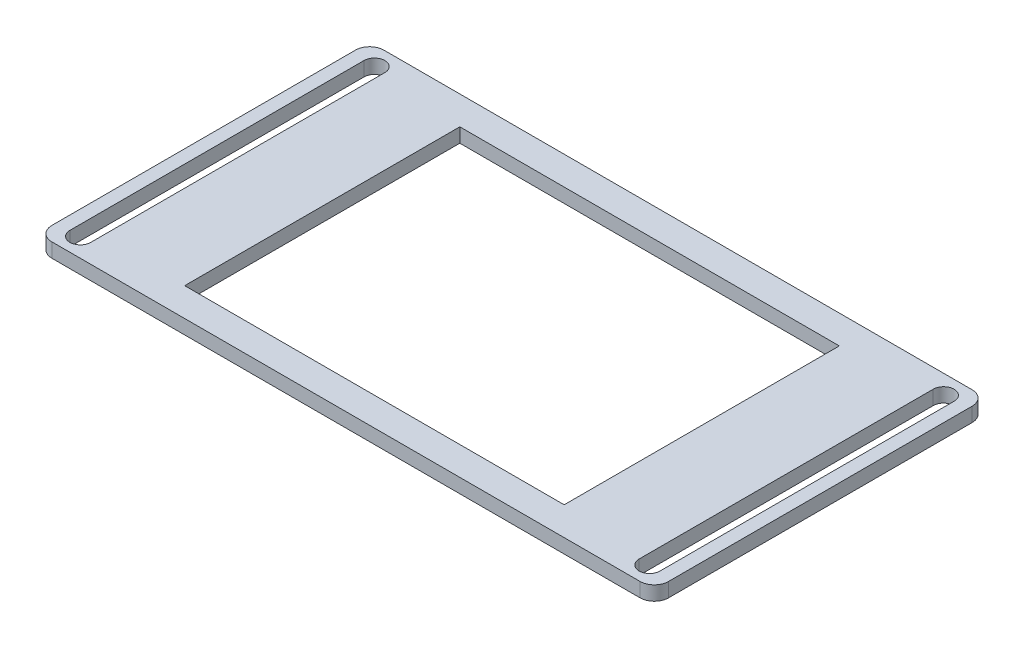
ISO-10303-21;
HEADER;
FILE_DESCRIPTION(('STEP AP214'),'2;1');
FILE_NAME('part.step','',(''),(''),'','','');
FILE_SCHEMA(('AUTOMOTIVE_DESIGN { 1 0 10303 214 1 1 1 1 }'));
ENDSEC;
DATA;
#1=APPLICATION_CONTEXT('core data for automotive mechanical design processes');
#2=APPLICATION_PROTOCOL_DEFINITION('international standard','automotive_design',2000,#1);
#3=PRODUCT_CONTEXT('',#1,'mechanical');
#4=PRODUCT('Part','Part','',(#3));
#5=PRODUCT_RELATED_PRODUCT_CATEGORY('part','',(#4));
#6=PRODUCT_DEFINITION_FORMATION('','',#4);
#7=PRODUCT_DEFINITION_CONTEXT('part definition',#1,'design');
#8=PRODUCT_DEFINITION('design','',#6,#7);
#9=PRODUCT_DEFINITION_SHAPE('','',#8);
#10=(LENGTH_UNIT() NAMED_UNIT(*) SI_UNIT(.MILLI.,.METRE.));
#11=(NAMED_UNIT(*) PLANE_ANGLE_UNIT() SI_UNIT($,.RADIAN.));
#12=(NAMED_UNIT(*) SI_UNIT($,.STERADIAN.) SOLID_ANGLE_UNIT());
#13=UNCERTAINTY_MEASURE_WITH_UNIT(LENGTH_MEASURE(1.E-05),#10,'distance_accuracy_value','');
#14=(GEOMETRIC_REPRESENTATION_CONTEXT(3) GLOBAL_UNCERTAINTY_ASSIGNED_CONTEXT((#13)) GLOBAL_UNIT_ASSIGNED_CONTEXT((#10,
#11,#12)) REPRESENTATION_CONTEXT('',''));
#15=CARTESIAN_POINT('',(0.,0.,0.));
#16=DIRECTION('',(0.,0.,1.));
#17=DIRECTION('',(1.,0.,0.));
#18=AXIS2_PLACEMENT_3D('',#15,#16,#17);
#19=CARTESIAN_POINT('',(0.,1.5,0.));
#20=DIRECTION('',(0.,-1.,0.));
#21=DIRECTION('',(0.,0.,-1.));
#22=AXIS2_PLACEMENT_3D('',#19,#20,#21);
#23=PLANE('',#22);
#24=DIRECTION('',(0.,0.,-1.));
#25=VECTOR('',#24,1.);
#26=CARTESIAN_POINT('',(31.1,1.5,15.5));
#27=LINE('',#26,#25);
#28=CARTESIAN_POINT('',(31.1,1.5,15.5));
#29=VERTEX_POINT('',#28);
#30=CARTESIAN_POINT('',(31.1,1.5,-15.5));
#31=VERTEX_POINT('',#30);
#32=EDGE_CURVE('E205',#29,#31,#27,.T.);
#33=ORIENTED_EDGE('',*,*,#32,.F.);
#34=CARTESIAN_POINT('',(30.,1.5,15.5));
#35=DIRECTION('',(0.,1.,0.));
#36=DIRECTION('',(0.,0.,-1.));
#37=AXIS2_PLACEMENT_3D('',#34,#35,#36);
#38=CIRCLE('',#37,1.10000000000001);
#39=CARTESIAN_POINT('',(28.9,1.5,15.5));
#40=VERTEX_POINT('',#39);
#41=EDGE_CURVE('E178',#40,#29,#38,.T.);
#42=ORIENTED_EDGE('',*,*,#41,.F.);
#43=DIRECTION('',(0.,0.,1.));
#44=VECTOR('',#43,1.);
#45=CARTESIAN_POINT('',(28.9,1.5,15.5));
#46=LINE('',#45,#44);
#47=CARTESIAN_POINT('',(28.9,1.5,-15.5));
#48=VERTEX_POINT('',#47);
#49=EDGE_CURVE('E196',#48,#40,#46,.T.);
#50=ORIENTED_EDGE('',*,*,#49,.F.);
#51=CARTESIAN_POINT('',(30.,1.5,-15.5));
#52=DIRECTION('',(0.,1.,0.));
#53=DIRECTION('',(0.,0.,-1.));
#54=AXIS2_PLACEMENT_3D('',#51,#52,#53);
#55=CIRCLE('',#54,1.10000000000001);
#56=EDGE_CURVE('E199',#31,#48,#55,.T.);
#57=ORIENTED_EDGE('',*,*,#56,.F.);
#58=EDGE_LOOP('',(#33,#42,#50,#57));
#59=FACE_BOUND('',#58,.T.);
#60=DIRECTION('',(0.,0.,-1.));
#61=VECTOR('',#60,1.);
#62=CARTESIAN_POINT('',(-28.9,1.5,15.5));
#63=LINE('',#62,#61);
#64=CARTESIAN_POINT('',(-28.9,1.5,15.5));
#65=VERTEX_POINT('',#64);
#66=CARTESIAN_POINT('',(-28.9,1.5,-15.5));
#67=VERTEX_POINT('',#66);
#68=EDGE_CURVE('E230',#65,#67,#63,.T.);
#69=ORIENTED_EDGE('',*,*,#68,.F.);
#70=CARTESIAN_POINT('',(-30.,1.5,15.5));
#71=DIRECTION('',(0.,1.,0.));
#72=DIRECTION('',(0.,0.,1.));
#73=AXIS2_PLACEMENT_3D('',#70,#71,#72);
#74=CIRCLE('',#73,1.10000000000001);
#75=CARTESIAN_POINT('',(-31.1,1.5,15.5));
#76=VERTEX_POINT('',#75);
#77=EDGE_CURVE('E211',#76,#65,#74,.T.);
#78=ORIENTED_EDGE('',*,*,#77,.F.);
#79=DIRECTION('',(0.,0.,1.));
#80=VECTOR('',#79,1.);
#81=CARTESIAN_POINT('',(-31.1,1.5,15.5));
#82=LINE('',#81,#80);
#83=CARTESIAN_POINT('',(-31.1,1.5,-15.5));
#84=VERTEX_POINT('',#83);
#85=EDGE_CURVE('E219',#84,#76,#82,.T.);
#86=ORIENTED_EDGE('',*,*,#85,.F.);
#87=CARTESIAN_POINT('',(-30.,1.5,-15.5));
#88=DIRECTION('',(0.,1.,0.));
#89=DIRECTION('',(0.,0.,1.));
#90=AXIS2_PLACEMENT_3D('',#87,#88,#89);
#91=CIRCLE('',#90,1.10000000000001);
#92=EDGE_CURVE('E233',#67,#84,#91,.T.);
#93=ORIENTED_EDGE('',*,*,#92,.F.);
#94=EDGE_LOOP('',(#69,#78,#86,#93));
#95=FACE_BOUND('',#94,.T.);
#96=DIRECTION('',(1.,0.,0.));
#97=VECTOR('',#96,1.);
#98=CARTESIAN_POINT('',(-32.5,1.5,17.5));
#99=LINE('',#98,#97);
#100=CARTESIAN_POINT('',(-31.,1.5,17.5));
#101=VERTEX_POINT('',#100);
#102=CARTESIAN_POINT('',(31.,1.5,17.5));
#103=VERTEX_POINT('',#102);
#104=EDGE_CURVE('E286',#101,#103,#99,.T.);
#105=ORIENTED_EDGE('',*,*,#104,.T.);
#106=CARTESIAN_POINT('',(31.,1.5,16.));
#107=DIRECTION('',(0.,-1.,0.));
#108=DIRECTION('',(0.,0.,-1.));
#109=AXIS2_PLACEMENT_3D('',#106,#107,#108);
#110=CIRCLE('',#109,1.5);
#111=CARTESIAN_POINT('',(32.5,1.5,16.));
#112=VERTEX_POINT('',#111);
#113=EDGE_CURVE('E321',#103,#112,#110,.F.);
#114=ORIENTED_EDGE('',*,*,#113,.T.);
#115=DIRECTION('',(0.,0.,-1.));
#116=VECTOR('',#115,1.);
#117=CARTESIAN_POINT('',(32.5,1.5,17.5));
#118=LINE('',#117,#116);
#119=CARTESIAN_POINT('',(32.5,1.5,-16.));
#120=VERTEX_POINT('',#119);
#121=EDGE_CURVE('E278',#112,#120,#118,.T.);
#122=ORIENTED_EDGE('',*,*,#121,.T.);
#123=CARTESIAN_POINT('',(31.,1.5,-16.));
#124=DIRECTION('',(0.,-1.,0.));
#125=DIRECTION('',(0.,0.,-1.));
#126=AXIS2_PLACEMENT_3D('',#123,#124,#125);
#127=CIRCLE('',#126,1.5);
#128=CARTESIAN_POINT('',(31.,1.5,-17.5));
#129=VERTEX_POINT('',#128);
#130=EDGE_CURVE('E317',#120,#129,#127,.F.);
#131=ORIENTED_EDGE('',*,*,#130,.T.);
#132=DIRECTION('',(-1.,0.,0.));
#133=VECTOR('',#132,1.);
#134=CARTESIAN_POINT('',(-32.5,1.5,-17.5));
#135=LINE('',#134,#133);
#136=CARTESIAN_POINT('',(-31.,1.5,-17.5));
#137=VERTEX_POINT('',#136);
#138=EDGE_CURVE('E281',#129,#137,#135,.T.);
#139=ORIENTED_EDGE('',*,*,#138,.T.);
#140=CARTESIAN_POINT('',(-31.,1.5,-16.));
#141=DIRECTION('',(0.,-1.,0.));
#142=DIRECTION('',(0.,0.,-1.));
#143=AXIS2_PLACEMENT_3D('',#140,#141,#142);
#144=CIRCLE('',#143,1.5);
#145=CARTESIAN_POINT('',(-32.5,1.5,-16.));
#146=VERTEX_POINT('',#145);
#147=EDGE_CURVE('E54',#137,#146,#144,.F.);
#148=ORIENTED_EDGE('',*,*,#147,.T.);
#149=DIRECTION('',(0.,0.,1.));
#150=VECTOR('',#149,1.);
#151=CARTESIAN_POINT('',(-32.5,1.5,17.5));
#152=LINE('',#151,#150);
#153=CARTESIAN_POINT('',(-32.5,1.5,16.));
#154=VERTEX_POINT('',#153);
#155=EDGE_CURVE('E284',#146,#154,#152,.T.);
#156=ORIENTED_EDGE('',*,*,#155,.T.);
#157=CARTESIAN_POINT('',(-31.,1.5,16.));
#158=DIRECTION('',(0.,-1.,0.));
#159=DIRECTION('',(0.,0.,-1.));
#160=AXIS2_PLACEMENT_3D('',#157,#158,#159);
#161=CIRCLE('',#160,1.5);
#162=EDGE_CURVE('E319',#154,#101,#161,.F.);
#163=ORIENTED_EDGE('',*,*,#162,.T.);
#164=EDGE_LOOP('',(#105,#114,#122,#131,#139,#148,#156,#163));
#165=FACE_BOUND('',#164,.T.);
#166=DIRECTION('',(0.,0.,-1.));
#167=VECTOR('',#166,1.);
#168=CARTESIAN_POINT('',(20.,1.5,14.5));
#169=LINE('',#168,#167);
#170=CARTESIAN_POINT('',(20.,1.5,14.5));
#171=VERTEX_POINT('',#170);
#172=CARTESIAN_POINT('',(20.,1.5,-14.5));
#173=VERTEX_POINT('',#172);
#174=EDGE_CURVE('E247',#171,#173,#169,.T.);
#175=ORIENTED_EDGE('',*,*,#174,.F.);
#176=DIRECTION('',(1.,0.,0.));
#177=VECTOR('',#176,1.);
#178=CARTESIAN_POINT('',(-20.,1.5,14.5));
#179=LINE('',#178,#177);
#180=CARTESIAN_POINT('',(-20.,1.5,14.5));
#181=VERTEX_POINT('',#180);
#182=EDGE_CURVE('E255',#181,#171,#179,.T.);
#183=ORIENTED_EDGE('',*,*,#182,.F.);
#184=DIRECTION('',(0.,0.,1.));
#185=VECTOR('',#184,1.);
#186=CARTESIAN_POINT('',(-20.,1.5,14.5));
#187=LINE('',#186,#185);
#188=CARTESIAN_POINT('',(-20.,1.5,-14.5));
#189=VERTEX_POINT('',#188);
#190=EDGE_CURVE('E252',#189,#181,#187,.T.);
#191=ORIENTED_EDGE('',*,*,#190,.F.);
#192=DIRECTION('',(-1.,0.,0.));
#193=VECTOR('',#192,1.);
#194=CARTESIAN_POINT('',(-20.,1.5,-14.5));
#195=LINE('',#194,#193);
#196=EDGE_CURVE('E249',#173,#189,#195,.T.);
#197=ORIENTED_EDGE('',*,*,#196,.F.);
#198=EDGE_LOOP('',(#175,#183,#191,#197));
#199=FACE_BOUND('',#198,.T.);
#200=ADVANCED_FACE('F32',(#59,#95,#165,#199),#23,.F.);
#201=CARTESIAN_POINT('',(0.,0.,0.));
#202=DIRECTION('',(0.,-1.,0.));
#203=DIRECTION('',(0.,0.,-1.));
#204=AXIS2_PLACEMENT_3D('',#201,#202,#203);
#205=PLANE('',#204);
#206=CARTESIAN_POINT('',(30.,0.,15.5));
#207=DIRECTION('',(0.,1.,0.));
#208=DIRECTION('',(0.,0.,-1.));
#209=AXIS2_PLACEMENT_3D('',#206,#207,#208);
#210=CIRCLE('',#209,1.10000000000001);
#211=CARTESIAN_POINT('',(28.9,0.,15.5));
#212=VERTEX_POINT('',#211);
#213=CARTESIAN_POINT('',(31.1,0.,15.5));
#214=VERTEX_POINT('',#213);
#215=EDGE_CURVE('E175',#212,#214,#210,.T.);
#216=ORIENTED_EDGE('',*,*,#215,.T.);
#217=DIRECTION('',(0.,0.,-1.));
#218=VECTOR('',#217,1.);
#219=CARTESIAN_POINT('',(31.1,0.,15.5));
#220=LINE('',#219,#218);
#221=CARTESIAN_POINT('',(31.1,0.,-15.5));
#222=VERTEX_POINT('',#221);
#223=EDGE_CURVE('E187',#214,#222,#220,.T.);
#224=ORIENTED_EDGE('',*,*,#223,.T.);
#225=CARTESIAN_POINT('',(30.,0.,-15.5));
#226=DIRECTION('',(0.,1.,0.));
#227=DIRECTION('',(0.,0.,-1.));
#228=AXIS2_PLACEMENT_3D('',#225,#226,#227);
#229=CIRCLE('',#228,1.10000000000001);
#230=CARTESIAN_POINT('',(28.9,0.,-15.5));
#231=VERTEX_POINT('',#230);
#232=EDGE_CURVE('E191',#222,#231,#229,.T.);
#233=ORIENTED_EDGE('',*,*,#232,.T.);
#234=DIRECTION('',(0.,0.,1.));
#235=VECTOR('',#234,1.);
#236=CARTESIAN_POINT('',(28.9,0.,15.5));
#237=LINE('',#236,#235);
#238=EDGE_CURVE('E183',#231,#212,#237,.T.);
#239=ORIENTED_EDGE('',*,*,#238,.T.);
#240=EDGE_LOOP('',(#216,#224,#233,#239));
#241=FACE_BOUND('',#240,.T.);
#242=CARTESIAN_POINT('',(-30.,0.,15.5));
#243=DIRECTION('',(0.,1.,0.));
#244=DIRECTION('',(0.,0.,1.));
#245=AXIS2_PLACEMENT_3D('',#242,#243,#244);
#246=CIRCLE('',#245,1.10000000000001);
#247=CARTESIAN_POINT('',(-31.1,0.,15.5));
#248=VERTEX_POINT('',#247);
#249=CARTESIAN_POINT('',(-28.9,0.,15.5));
#250=VERTEX_POINT('',#249);
#251=EDGE_CURVE('E215',#248,#250,#246,.T.);
#252=ORIENTED_EDGE('',*,*,#251,.T.);
#253=DIRECTION('',(0.,0.,-1.));
#254=VECTOR('',#253,1.);
#255=CARTESIAN_POINT('',(-28.9,0.,15.5));
#256=LINE('',#255,#254);
#257=CARTESIAN_POINT('',(-28.9,0.,-15.5));
#258=VERTEX_POINT('',#257);
#259=EDGE_CURVE('E218',#250,#258,#256,.T.);
#260=ORIENTED_EDGE('',*,*,#259,.T.);
#261=CARTESIAN_POINT('',(-30.,0.,-15.5));
#262=DIRECTION('',(0.,1.,0.));
#263=DIRECTION('',(0.,0.,1.));
#264=AXIS2_PLACEMENT_3D('',#261,#262,#263);
#265=CIRCLE('',#264,1.10000000000001);
#266=CARTESIAN_POINT('',(-31.1,0.,-15.5));
#267=VERTEX_POINT('',#266);
#268=EDGE_CURVE('E222',#258,#267,#265,.T.);
#269=ORIENTED_EDGE('',*,*,#268,.T.);
#270=DIRECTION('',(0.,0.,1.));
#271=VECTOR('',#270,1.);
#272=CARTESIAN_POINT('',(-31.1,0.,15.5));
#273=LINE('',#272,#271);
#274=EDGE_CURVE('E225',#267,#248,#273,.T.);
#275=ORIENTED_EDGE('',*,*,#274,.T.);
#276=EDGE_LOOP('',(#252,#260,#269,#275));
#277=FACE_BOUND('',#276,.T.);
#278=DIRECTION('',(0.,0.,-1.));
#279=VECTOR('',#278,1.);
#280=CARTESIAN_POINT('',(32.5,0.,17.5));
#281=LINE('',#280,#279);
#282=CARTESIAN_POINT('',(32.5,0.,16.));
#283=VERTEX_POINT('',#282);
#284=CARTESIAN_POINT('',(32.5,0.,-16.));
#285=VERTEX_POINT('',#284);
#286=EDGE_CURVE('E277',#283,#285,#281,.T.);
#287=ORIENTED_EDGE('',*,*,#286,.F.);
#288=CARTESIAN_POINT('',(31.,0.,16.));
#289=DIRECTION('',(0.,-1.,0.));
#290=DIRECTION('',(0.,0.,-1.));
#291=AXIS2_PLACEMENT_3D('',#288,#289,#290);
#292=CIRCLE('',#291,1.5);
#293=CARTESIAN_POINT('',(31.,0.,17.5));
#294=VERTEX_POINT('',#293);
#295=EDGE_CURVE('E309',#283,#294,#292,.T.);
#296=ORIENTED_EDGE('',*,*,#295,.T.);
#297=DIRECTION('',(1.,0.,0.));
#298=VECTOR('',#297,1.);
#299=CARTESIAN_POINT('',(-32.5,0.,17.5));
#300=LINE('',#299,#298);
#301=CARTESIAN_POINT('',(-31.,0.,17.5));
#302=VERTEX_POINT('',#301);
#303=EDGE_CURVE('E282',#302,#294,#300,.T.);
#304=ORIENTED_EDGE('',*,*,#303,.F.);
#305=CARTESIAN_POINT('',(-31.,0.,16.));
#306=DIRECTION('',(0.,-1.,0.));
#307=DIRECTION('',(0.,0.,-1.));
#308=AXIS2_PLACEMENT_3D('',#305,#306,#307);
#309=CIRCLE('',#308,1.5);
#310=CARTESIAN_POINT('',(-32.5,0.,16.));
#311=VERTEX_POINT('',#310);
#312=EDGE_CURVE('E307',#302,#311,#309,.T.);
#313=ORIENTED_EDGE('',*,*,#312,.T.);
#314=DIRECTION('',(0.,0.,1.));
#315=VECTOR('',#314,1.);
#316=CARTESIAN_POINT('',(-32.5,0.,17.5));
#317=LINE('',#316,#315);
#318=CARTESIAN_POINT('',(-32.5,0.,-16.));
#319=VERTEX_POINT('',#318);
#320=EDGE_CURVE('E295',#319,#311,#317,.T.);
#321=ORIENTED_EDGE('',*,*,#320,.F.);
#322=CARTESIAN_POINT('',(-31.,0.,-16.));
#323=DIRECTION('',(0.,-1.,0.));
#324=DIRECTION('',(0.,0.,-1.));
#325=AXIS2_PLACEMENT_3D('',#322,#323,#324);
#326=CIRCLE('',#325,1.5);
#327=CARTESIAN_POINT('',(-31.,0.,-17.5));
#328=VERTEX_POINT('',#327);
#329=EDGE_CURVE('E303',#319,#328,#326,.T.);
#330=ORIENTED_EDGE('',*,*,#329,.T.);
#331=DIRECTION('',(-1.,0.,0.));
#332=VECTOR('',#331,1.);
#333=CARTESIAN_POINT('',(-32.5,0.,-17.5));
#334=LINE('',#333,#332);
#335=CARTESIAN_POINT('',(31.,0.,-17.5));
#336=VERTEX_POINT('',#335);
#337=EDGE_CURVE('E292',#336,#328,#334,.T.);
#338=ORIENTED_EDGE('',*,*,#337,.F.);
#339=CARTESIAN_POINT('',(31.,0.,-16.));
#340=DIRECTION('',(0.,-1.,0.));
#341=DIRECTION('',(0.,0.,-1.));
#342=AXIS2_PLACEMENT_3D('',#339,#340,#341);
#343=CIRCLE('',#342,1.5);
#344=EDGE_CURVE('E305',#336,#285,#343,.T.);
#345=ORIENTED_EDGE('',*,*,#344,.T.);
#346=EDGE_LOOP('',(#287,#296,#304,#313,#321,#330,#338,#345));
#347=FACE_BOUND('',#346,.T.);
#348=DIRECTION('',(1.,0.,0.));
#349=VECTOR('',#348,1.);
#350=CARTESIAN_POINT('',(-20.,0.,14.5));
#351=LINE('',#350,#349);
#352=CARTESIAN_POINT('',(-20.,0.,14.5));
#353=VERTEX_POINT('',#352);
#354=CARTESIAN_POINT('',(20.,0.,14.5));
#355=VERTEX_POINT('',#354);
#356=EDGE_CURVE('E250',#353,#355,#351,.T.);
#357=ORIENTED_EDGE('',*,*,#356,.T.);
#358=DIRECTION('',(0.,0.,-1.));
#359=VECTOR('',#358,1.);
#360=CARTESIAN_POINT('',(20.,0.,14.5));
#361=LINE('',#360,#359);
#362=CARTESIAN_POINT('',(20.,0.,-14.5));
#363=VERTEX_POINT('',#362);
#364=EDGE_CURVE('E240',#355,#363,#361,.T.);
#365=ORIENTED_EDGE('',*,*,#364,.T.);
#366=DIRECTION('',(-1.,0.,0.));
#367=VECTOR('',#366,1.);
#368=CARTESIAN_POINT('',(-20.,0.,-14.5));
#369=LINE('',#368,#367);
#370=CARTESIAN_POINT('',(-20.,0.,-14.5));
#371=VERTEX_POINT('',#370);
#372=EDGE_CURVE('E260',#363,#371,#369,.T.);
#373=ORIENTED_EDGE('',*,*,#372,.T.);
#374=DIRECTION('',(0.,0.,1.));
#375=VECTOR('',#374,1.);
#376=CARTESIAN_POINT('',(-20.,0.,14.5));
#377=LINE('',#376,#375);
#378=EDGE_CURVE('E263',#371,#353,#377,.T.);
#379=ORIENTED_EDGE('',*,*,#378,.T.);
#380=EDGE_LOOP('',(#357,#365,#373,#379));
#381=FACE_BOUND('',#380,.T.);
#382=ADVANCED_FACE('F193',(#241,#277,#347,#381),#205,.T.);
#383=CARTESIAN_POINT('',(32.5,1.5,17.5));
#384=DIRECTION('',(-1.,0.,0.));
#385=DIRECTION('',(0.,0.,1.));
#386=AXIS2_PLACEMENT_3D('',#383,#384,#385);
#387=PLANE('',#386);
#388=ORIENTED_EDGE('',*,*,#121,.F.);
#389=DIRECTION('',(0.,-1.,0.));
#390=VECTOR('',#389,1.);
#391=CARTESIAN_POINT('',(32.5,1.5,16.));
#392=LINE('',#391,#390);
#393=EDGE_CURVE('E300',#112,#283,#392,.T.);
#394=ORIENTED_EDGE('',*,*,#393,.T.);
#395=ORIENTED_EDGE('',*,*,#286,.T.);
#396=DIRECTION('',(0.,-1.,0.));
#397=VECTOR('',#396,1.);
#398=CARTESIAN_POINT('',(32.5,1.5,-16.));
#399=LINE('',#398,#397);
#400=EDGE_CURVE('E289',#285,#120,#399,.F.);
#401=ORIENTED_EDGE('',*,*,#400,.T.);
#402=EDGE_LOOP('',(#388,#394,#395,#401));
#403=FACE_BOUND('',#402,.T.);
#404=ADVANCED_FACE('F356',(#403),#387,.F.);
#405=CARTESIAN_POINT('',(-32.5,1.5,-17.5));
#406=DIRECTION('',(0.,0.,1.));
#407=DIRECTION('',(1.,0.,0.));
#408=AXIS2_PLACEMENT_3D('',#405,#406,#407);
#409=PLANE('',#408);
#410=ORIENTED_EDGE('',*,*,#138,.F.);
#411=DIRECTION('',(0.,-1.,0.));
#412=VECTOR('',#411,1.);
#413=CARTESIAN_POINT('',(31.,1.5,-17.5));
#414=LINE('',#413,#412);
#415=EDGE_CURVE('E11',#129,#336,#414,.T.);
#416=ORIENTED_EDGE('',*,*,#415,.T.);
#417=ORIENTED_EDGE('',*,*,#337,.T.);
#418=DIRECTION('',(0.,-1.,0.));
#419=VECTOR('',#418,1.);
#420=CARTESIAN_POINT('',(-31.,1.5,-17.5));
#421=LINE('',#420,#419);
#422=EDGE_CURVE('E40',#328,#137,#421,.F.);
#423=ORIENTED_EDGE('',*,*,#422,.T.);
#424=EDGE_LOOP('',(#410,#416,#417,#423));
#425=FACE_BOUND('',#424,.T.);
#426=ADVANCED_FACE('F329',(#425),#409,.F.);
#427=CARTESIAN_POINT('',(-32.5,1.5,17.5));
#428=DIRECTION('',(1.,0.,0.));
#429=DIRECTION('',(0.,0.,-1.));
#430=AXIS2_PLACEMENT_3D('',#427,#428,#429);
#431=PLANE('',#430);
#432=ORIENTED_EDGE('',*,*,#320,.T.);
#433=DIRECTION('',(0.,-1.,0.));
#434=VECTOR('',#433,1.);
#435=CARTESIAN_POINT('',(-32.5,1.5,16.));
#436=LINE('',#435,#434);
#437=EDGE_CURVE('E47',#311,#154,#436,.F.);
#438=ORIENTED_EDGE('',*,*,#437,.T.);
#439=ORIENTED_EDGE('',*,*,#155,.F.);
#440=DIRECTION('',(0.,-1.,0.));
#441=VECTOR('',#440,1.);
#442=CARTESIAN_POINT('',(-32.5,1.5,-16.));
#443=LINE('',#442,#441);
#444=EDGE_CURVE('E323',#146,#319,#443,.T.);
#445=ORIENTED_EDGE('',*,*,#444,.T.);
#446=EDGE_LOOP('',(#432,#438,#439,#445));
#447=FACE_BOUND('',#446,.T.);
#448=ADVANCED_FACE('F337',(#447),#431,.F.);
#449=CARTESIAN_POINT('',(-32.5,1.5,17.5));
#450=DIRECTION('',(0.,0.,-1.));
#451=DIRECTION('',(-1.,0.,0.));
#452=AXIS2_PLACEMENT_3D('',#449,#450,#451);
#453=PLANE('',#452);
#454=ORIENTED_EDGE('',*,*,#303,.T.);
#455=DIRECTION('',(0.,-1.,0.));
#456=VECTOR('',#455,1.);
#457=CARTESIAN_POINT('',(31.,1.5,17.5));
#458=LINE('',#457,#456);
#459=EDGE_CURVE('E314',#294,#103,#458,.F.);
#460=ORIENTED_EDGE('',*,*,#459,.T.);
#461=ORIENTED_EDGE('',*,*,#104,.F.);
#462=DIRECTION('',(0.,-1.,0.));
#463=VECTOR('',#462,1.);
#464=CARTESIAN_POINT('',(-31.,1.5,17.5));
#465=LINE('',#464,#463);
#466=EDGE_CURVE('E311',#101,#302,#465,.T.);
#467=ORIENTED_EDGE('',*,*,#466,.T.);
#468=EDGE_LOOP('',(#454,#460,#461,#467));
#469=FACE_BOUND('',#468,.T.);
#470=ADVANCED_FACE('F348',(#469),#453,.F.);
#471=CARTESIAN_POINT('',(20.,1.5,14.5));
#472=DIRECTION('',(-1.,0.,0.));
#473=DIRECTION('',(0.,0.,1.));
#474=AXIS2_PLACEMENT_3D('',#471,#472,#473);
#475=PLANE('',#474);
#476=ORIENTED_EDGE('',*,*,#364,.F.);
#477=DIRECTION('',(0.,-1.,0.));
#478=VECTOR('',#477,1.);
#479=CARTESIAN_POINT('',(20.,1.5,14.5));
#480=LINE('',#479,#478);
#481=EDGE_CURVE('E257',#171,#355,#480,.T.);
#482=ORIENTED_EDGE('',*,*,#481,.F.);
#483=ORIENTED_EDGE('',*,*,#174,.T.);
#484=DIRECTION('',(0.,-1.,0.));
#485=VECTOR('',#484,1.);
#486=CARTESIAN_POINT('',(20.,1.5,-14.5));
#487=LINE('',#486,#485);
#488=EDGE_CURVE('E274',#173,#363,#487,.T.);
#489=ORIENTED_EDGE('',*,*,#488,.T.);
#490=EDGE_LOOP('',(#476,#482,#483,#489));
#491=FACE_BOUND('',#490,.T.);
#492=ADVANCED_FACE('F375',(#491),#475,.T.);
#493=CARTESIAN_POINT('',(-20.,1.5,-14.5));
#494=DIRECTION('',(0.,0.,1.));
#495=DIRECTION('',(1.,0.,0.));
#496=AXIS2_PLACEMENT_3D('',#493,#494,#495);
#497=PLANE('',#496);
#498=ORIENTED_EDGE('',*,*,#372,.F.);
#499=ORIENTED_EDGE('',*,*,#488,.F.);
#500=ORIENTED_EDGE('',*,*,#196,.T.);
#501=DIRECTION('',(0.,-1.,0.));
#502=VECTOR('',#501,1.);
#503=CARTESIAN_POINT('',(-20.,1.5,-14.5));
#504=LINE('',#503,#502);
#505=EDGE_CURVE('E272',#189,#371,#504,.T.);
#506=ORIENTED_EDGE('',*,*,#505,.T.);
#507=EDGE_LOOP('',(#498,#499,#500,#506));
#508=FACE_BOUND('',#507,.T.);
#509=ADVANCED_FACE('F424',(#508),#497,.T.);
#510=CARTESIAN_POINT('',(-20.,1.5,14.5));
#511=DIRECTION('',(1.,0.,0.));
#512=DIRECTION('',(0.,0.,-1.));
#513=AXIS2_PLACEMENT_3D('',#510,#511,#512);
#514=PLANE('',#513);
#515=ORIENTED_EDGE('',*,*,#378,.F.);
#516=ORIENTED_EDGE('',*,*,#505,.F.);
#517=ORIENTED_EDGE('',*,*,#190,.T.);
#518=DIRECTION('',(0.,-1.,0.));
#519=VECTOR('',#518,1.);
#520=CARTESIAN_POINT('',(-20.,1.5,14.5));
#521=LINE('',#520,#519);
#522=EDGE_CURVE('E270',#181,#353,#521,.T.);
#523=ORIENTED_EDGE('',*,*,#522,.T.);
#524=EDGE_LOOP('',(#515,#516,#517,#523));
#525=FACE_BOUND('',#524,.T.);
#526=ADVANCED_FACE('F421',(#525),#514,.T.);
#527=CARTESIAN_POINT('',(-20.,1.5,14.5));
#528=DIRECTION('',(0.,0.,-1.));
#529=DIRECTION('',(-1.,0.,0.));
#530=AXIS2_PLACEMENT_3D('',#527,#528,#529);
#531=PLANE('',#530);
#532=ORIENTED_EDGE('',*,*,#356,.F.);
#533=ORIENTED_EDGE('',*,*,#522,.F.);
#534=ORIENTED_EDGE('',*,*,#182,.T.);
#535=ORIENTED_EDGE('',*,*,#481,.T.);
#536=EDGE_LOOP('',(#532,#533,#534,#535));
#537=FACE_BOUND('',#536,.T.);
#538=ADVANCED_FACE('F417',(#537),#531,.T.);
#539=CARTESIAN_POINT('',(-30.,0.,15.5));
#540=DIRECTION('',(0.,1.,0.));
#541=DIRECTION('',(0.,0.,1.));
#542=AXIS2_PLACEMENT_3D('',#539,#540,#541);
#543=CYLINDRICAL_SURFACE('',#542,1.10000000000001);
#544=ORIENTED_EDGE('',*,*,#77,.T.);
#545=DIRECTION('',(0.,1.,0.));
#546=VECTOR('',#545,1.);
#547=CARTESIAN_POINT('',(-28.9,0.,15.5));
#548=LINE('',#547,#546);
#549=EDGE_CURVE('E228',#250,#65,#548,.T.);
#550=ORIENTED_EDGE('',*,*,#549,.F.);
#551=ORIENTED_EDGE('',*,*,#251,.F.);
#552=DIRECTION('',(0.,1.,0.));
#553=VECTOR('',#552,1.);
#554=CARTESIAN_POINT('',(-31.1,0.,15.5));
#555=LINE('',#554,#553);
#556=EDGE_CURVE('E238',#248,#76,#555,.T.);
#557=ORIENTED_EDGE('',*,*,#556,.T.);
#558=EDGE_LOOP('',(#544,#550,#551,#557));
#559=FACE_BOUND('',#558,.T.);
#560=ADVANCED_FACE('F407',(#559),#543,.F.);
#561=CARTESIAN_POINT('',(-31.1,0.,15.5));
#562=DIRECTION('',(-1.,0.,0.));
#563=DIRECTION('',(0.,0.,1.));
#564=AXIS2_PLACEMENT_3D('',#561,#562,#563);
#565=PLANE('',#564);
#566=ORIENTED_EDGE('',*,*,#85,.T.);
#567=ORIENTED_EDGE('',*,*,#556,.F.);
#568=ORIENTED_EDGE('',*,*,#274,.F.);
#569=DIRECTION('',(0.,1.,0.));
#570=VECTOR('',#569,1.);
#571=CARTESIAN_POINT('',(-31.1,0.,-15.5));
#572=LINE('',#571,#570);
#573=EDGE_CURVE('E241',#267,#84,#572,.T.);
#574=ORIENTED_EDGE('',*,*,#573,.T.);
#575=EDGE_LOOP('',(#566,#567,#568,#574));
#576=FACE_BOUND('',#575,.T.);
#577=ADVANCED_FACE('F403',(#576),#565,.F.);
#578=CARTESIAN_POINT('',(-30.,0.,-15.5));
#579=DIRECTION('',(0.,1.,0.));
#580=DIRECTION('',(0.,0.,1.));
#581=AXIS2_PLACEMENT_3D('',#578,#579,#580);
#582=CYLINDRICAL_SURFACE('',#581,1.10000000000001);
#583=ORIENTED_EDGE('',*,*,#92,.T.);
#584=ORIENTED_EDGE('',*,*,#573,.F.);
#585=ORIENTED_EDGE('',*,*,#268,.F.);
#586=DIRECTION('',(0.,1.,0.));
#587=VECTOR('',#586,1.);
#588=CARTESIAN_POINT('',(-28.9,0.,-15.5));
#589=LINE('',#588,#587);
#590=EDGE_CURVE('E243',#258,#67,#589,.T.);
#591=ORIENTED_EDGE('',*,*,#590,.T.);
#592=EDGE_LOOP('',(#583,#584,#585,#591));
#593=FACE_BOUND('',#592,.T.);
#594=ADVANCED_FACE('F406',(#593),#582,.F.);
#595=CARTESIAN_POINT('',(-28.9,0.,15.5));
#596=DIRECTION('',(1.,0.,0.));
#597=DIRECTION('',(0.,0.,-1.));
#598=AXIS2_PLACEMENT_3D('',#595,#596,#597);
#599=PLANE('',#598);
#600=ORIENTED_EDGE('',*,*,#68,.T.);
#601=ORIENTED_EDGE('',*,*,#590,.F.);
#602=ORIENTED_EDGE('',*,*,#259,.F.);
#603=ORIENTED_EDGE('',*,*,#549,.T.);
#604=EDGE_LOOP('',(#600,#601,#602,#603));
#605=FACE_BOUND('',#604,.T.);
#606=ADVANCED_FACE('F402',(#605),#599,.F.);
#607=CARTESIAN_POINT('',(30.,0.,15.5));
#608=DIRECTION('',(0.,1.,0.));
#609=DIRECTION('',(0.,0.,1.));
#610=AXIS2_PLACEMENT_3D('',#607,#608,#609);
#611=CYLINDRICAL_SURFACE('',#610,1.10000000000001);
#612=ORIENTED_EDGE('',*,*,#41,.T.);
#613=DIRECTION('',(0.,1.,0.));
#614=VECTOR('',#613,1.);
#615=CARTESIAN_POINT('',(31.1,0.,15.5));
#616=LINE('',#615,#614);
#617=EDGE_CURVE('E171',#214,#29,#616,.T.);
#618=ORIENTED_EDGE('',*,*,#617,.F.);
#619=ORIENTED_EDGE('',*,*,#215,.F.);
#620=DIRECTION('',(0.,1.,0.));
#621=VECTOR('',#620,1.);
#622=CARTESIAN_POINT('',(28.9,0.,15.5));
#623=LINE('',#622,#621);
#624=EDGE_CURVE('E209',#212,#40,#623,.T.);
#625=ORIENTED_EDGE('',*,*,#624,.T.);
#626=EDGE_LOOP('',(#612,#618,#619,#625));
#627=FACE_BOUND('',#626,.T.);
#628=ADVANCED_FACE('F173',(#627),#611,.F.);
#629=CARTESIAN_POINT('',(28.9,0.,15.5));
#630=DIRECTION('',(-1.,0.,0.));
#631=DIRECTION('',(0.,0.,1.));
#632=AXIS2_PLACEMENT_3D('',#629,#630,#631);
#633=PLANE('',#632);
#634=ORIENTED_EDGE('',*,*,#49,.T.);
#635=ORIENTED_EDGE('',*,*,#624,.F.);
#636=ORIENTED_EDGE('',*,*,#238,.F.);
#637=DIRECTION('',(0.,1.,0.));
#638=VECTOR('',#637,1.);
#639=CARTESIAN_POINT('',(28.9,0.,-15.5));
#640=LINE('',#639,#638);
#641=EDGE_CURVE('E212',#231,#48,#640,.T.);
#642=ORIENTED_EDGE('',*,*,#641,.T.);
#643=EDGE_LOOP('',(#634,#635,#636,#642));
#644=FACE_BOUND('',#643,.T.);
#645=ADVANCED_FACE('F395',(#644),#633,.F.);
#646=CARTESIAN_POINT('',(30.,0.,-15.5));
#647=DIRECTION('',(0.,1.,0.));
#648=DIRECTION('',(0.,0.,1.));
#649=AXIS2_PLACEMENT_3D('',#646,#647,#648);
#650=CYLINDRICAL_SURFACE('',#649,1.10000000000001);
#651=ORIENTED_EDGE('',*,*,#56,.T.);
#652=ORIENTED_EDGE('',*,*,#641,.F.);
#653=ORIENTED_EDGE('',*,*,#232,.F.);
#654=DIRECTION('',(0.,1.,0.));
#655=VECTOR('',#654,1.);
#656=CARTESIAN_POINT('',(31.1,0.,-15.5));
#657=LINE('',#656,#655);
#658=EDGE_CURVE('E182',#222,#31,#657,.T.);
#659=ORIENTED_EDGE('',*,*,#658,.T.);
#660=EDGE_LOOP('',(#651,#652,#653,#659));
#661=FACE_BOUND('',#660,.T.);
#662=ADVANCED_FACE('F390',(#661),#650,.F.);
#663=CARTESIAN_POINT('',(31.1,0.,15.5));
#664=DIRECTION('',(1.,0.,0.));
#665=DIRECTION('',(0.,0.,-1.));
#666=AXIS2_PLACEMENT_3D('',#663,#664,#665);
#667=PLANE('',#666);
#668=ORIENTED_EDGE('',*,*,#32,.T.);
#669=ORIENTED_EDGE('',*,*,#658,.F.);
#670=ORIENTED_EDGE('',*,*,#223,.F.);
#671=ORIENTED_EDGE('',*,*,#617,.T.);
#672=EDGE_LOOP('',(#668,#669,#670,#671));
#673=FACE_BOUND('',#672,.T.);
#674=ADVANCED_FACE('F188',(#673),#667,.F.);
#675=CARTESIAN_POINT('',(31.,1.5,16.));
#676=DIRECTION('',(0.,-1.,0.));
#677=DIRECTION('',(0.,0.,-1.));
#678=AXIS2_PLACEMENT_3D('',#675,#676,#677);
#679=CYLINDRICAL_SURFACE('',#678,1.5);
#680=ORIENTED_EDGE('',*,*,#113,.F.);
#681=ORIENTED_EDGE('',*,*,#459,.F.);
#682=ORIENTED_EDGE('',*,*,#295,.F.);
#683=ORIENTED_EDGE('',*,*,#393,.F.);
#684=EDGE_LOOP('',(#680,#681,#682,#683));
#685=FACE_BOUND('',#684,.T.);
#686=ADVANCED_FACE('F354',(#685),#679,.T.);
#687=CARTESIAN_POINT('',(-31.,1.5,16.));
#688=DIRECTION('',(0.,-1.,0.));
#689=DIRECTION('',(0.,0.,-1.));
#690=AXIS2_PLACEMENT_3D('',#687,#688,#689);
#691=CYLINDRICAL_SURFACE('',#690,1.5);
#692=ORIENTED_EDGE('',*,*,#162,.F.);
#693=ORIENTED_EDGE('',*,*,#437,.F.);
#694=ORIENTED_EDGE('',*,*,#312,.F.);
#695=ORIENTED_EDGE('',*,*,#466,.F.);
#696=EDGE_LOOP('',(#692,#693,#694,#695));
#697=FACE_BOUND('',#696,.T.);
#698=ADVANCED_FACE('F345',(#697),#691,.T.);
#699=CARTESIAN_POINT('',(31.,1.5,-16.));
#700=DIRECTION('',(0.,-1.,0.));
#701=DIRECTION('',(0.,0.,-1.));
#702=AXIS2_PLACEMENT_3D('',#699,#700,#701);
#703=CYLINDRICAL_SURFACE('',#702,1.5);
#704=ORIENTED_EDGE('',*,*,#130,.F.);
#705=ORIENTED_EDGE('',*,*,#400,.F.);
#706=ORIENTED_EDGE('',*,*,#344,.F.);
#707=ORIENTED_EDGE('',*,*,#415,.F.);
#708=EDGE_LOOP('',(#704,#705,#706,#707));
#709=FACE_BOUND('',#708,.T.);
#710=ADVANCED_FACE('F359',(#709),#703,.T.);
#711=CARTESIAN_POINT('',(-31.,1.5,-16.));
#712=DIRECTION('',(0.,-1.,0.));
#713=DIRECTION('',(0.,0.,-1.));
#714=AXIS2_PLACEMENT_3D('',#711,#712,#713);
#715=CYLINDRICAL_SURFACE('',#714,1.5);
#716=ORIENTED_EDGE('',*,*,#147,.F.);
#717=ORIENTED_EDGE('',*,*,#422,.F.);
#718=ORIENTED_EDGE('',*,*,#329,.F.);
#719=ORIENTED_EDGE('',*,*,#444,.F.);
#720=EDGE_LOOP('',(#716,#717,#718,#719));
#721=FACE_BOUND('',#720,.T.);
#722=ADVANCED_FACE('F34',(#721),#715,.T.);
#723=CLOSED_SHELL('',(#200,#382,#404,#426,#448,#470,#492,#509,#526,#538,#560,#577,#594,#606,
#628,#645,#662,#674,#686,#698,#710,#722));
#724=MANIFOLD_SOLID_BREP('B2',#723);
#725=ADVANCED_BREP_SHAPE_REPRESENTATION('',(#18,#724),#14);
#726=SHAPE_DEFINITION_REPRESENTATION(#9,#725);
ENDSEC;
END-ISO-10303-21;
